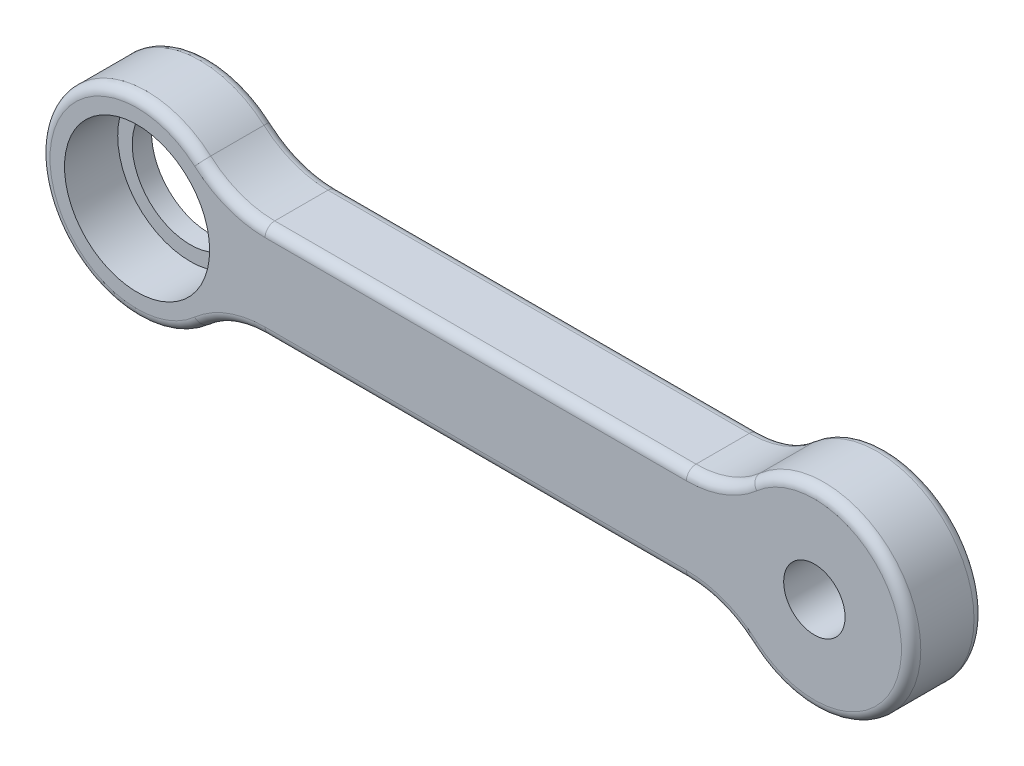
ISO-10303-21;
HEADER;
FILE_DESCRIPTION(('STEP AP214'),'2;1');
FILE_NAME('part.step','',(''),(''),'','','');
FILE_SCHEMA(('AUTOMOTIVE_DESIGN { 1 0 10303 214 1 1 1 1 }'));
ENDSEC;
DATA;
#1=APPLICATION_CONTEXT('core data for automotive mechanical design processes');
#2=APPLICATION_PROTOCOL_DEFINITION('international standard','automotive_design',2000,#1);
#3=PRODUCT_CONTEXT('',#1,'mechanical');
#4=PRODUCT('Part','Part','',(#3));
#5=PRODUCT_RELATED_PRODUCT_CATEGORY('part','',(#4));
#6=PRODUCT_DEFINITION_FORMATION('','',#4);
#7=PRODUCT_DEFINITION_CONTEXT('part definition',#1,'design');
#8=PRODUCT_DEFINITION('design','',#6,#7);
#9=PRODUCT_DEFINITION_SHAPE('','',#8);
#10=(LENGTH_UNIT() NAMED_UNIT(*) SI_UNIT(.MILLI.,.METRE.));
#11=(NAMED_UNIT(*) PLANE_ANGLE_UNIT() SI_UNIT($,.RADIAN.));
#12=(NAMED_UNIT(*) SI_UNIT($,.STERADIAN.) SOLID_ANGLE_UNIT());
#13=UNCERTAINTY_MEASURE_WITH_UNIT(LENGTH_MEASURE(1.E-05),#10,'distance_accuracy_value','');
#14=(GEOMETRIC_REPRESENTATION_CONTEXT(3) GLOBAL_UNCERTAINTY_ASSIGNED_CONTEXT((#13)) GLOBAL_UNIT_ASSIGNED_CONTEXT((#10,
#11,#12)) REPRESENTATION_CONTEXT('',''));
#15=CARTESIAN_POINT('',(0.,0.,0.));
#16=DIRECTION('',(0.,0.,1.));
#17=DIRECTION('',(1.,0.,0.));
#18=AXIS2_PLACEMENT_3D('',#15,#16,#17);
#19=CARTESIAN_POINT('',(21.7712434446771,-15.,7.5));
#20=DIRECTION('',(0.,0.,-1.));
#21=DIRECTION('',(-1.,0.,0.));
#22=AXIS2_PLACEMENT_3D('',#19,#20,#21);
#23=CYLINDRICAL_SURFACE('',#22,10.);
#24=DIRECTION('',(0.,0.,-1.));
#25=VECTOR('',#24,1.);
#26=CARTESIAN_POINT('',(21.7712434446771,-5.,7.5));
#27=LINE('',#26,#25);
#28=CARTESIAN_POINT('',(21.7712434446771,-5.,6.5));
#29=VERTEX_POINT('',#28);
#30=CARTESIAN_POINT('',(21.7712434446771,-5.,1.));
#31=VERTEX_POINT('',#30);
#32=EDGE_CURVE('E153',#29,#31,#27,.T.);
#33=ORIENTED_EDGE('',*,*,#32,.T.);
#34=CARTESIAN_POINT('',(21.7712434446771,-15.,1.));
#35=DIRECTION('',(0.,0.,-1.));
#36=DIRECTION('',(-1.,0.,0.));
#37=AXIS2_PLACEMENT_3D('',#34,#35,#36);
#38=CIRCLE('',#37,10.);
#39=CARTESIAN_POINT('',(28.3856217223385,-7.5,1.));
#40=VERTEX_POINT('',#39);
#41=EDGE_CURVE('E236',#31,#40,#38,.T.);
#42=ORIENTED_EDGE('',*,*,#41,.T.);
#43=DIRECTION('',(0.,0.,-1.));
#44=VECTOR('',#43,1.);
#45=CARTESIAN_POINT('',(28.3856217223385,-7.5,7.5));
#46=LINE('',#45,#44);
#47=CARTESIAN_POINT('',(28.3856217223385,-7.5,6.5));
#48=VERTEX_POINT('',#47);
#49=EDGE_CURVE('E177',#48,#40,#46,.T.);
#50=ORIENTED_EDGE('',*,*,#49,.F.);
#51=CARTESIAN_POINT('',(21.7712434446771,-15.,6.5));
#52=DIRECTION('',(0.,0.,-1.));
#53=DIRECTION('',(-1.,0.,0.));
#54=AXIS2_PLACEMENT_3D('',#51,#52,#53);
#55=CIRCLE('',#54,10.);
#56=EDGE_CURVE('E238',#48,#29,#55,.F.);
#57=ORIENTED_EDGE('',*,*,#56,.T.);
#58=EDGE_LOOP('',(#33,#42,#50,#57));
#59=FACE_BOUND('',#58,.T.);
#60=ADVANCED_FACE('F34',(#59),#23,.F.);
#61=CARTESIAN_POINT('',(35.,0.,7.5));
#62=DIRECTION('',(0.,0.,-1.));
#63=DIRECTION('',(-1.,0.,0.));
#64=AXIS2_PLACEMENT_3D('',#61,#62,#63);
#65=CYLINDRICAL_SURFACE('',#64,10.);
#66=ORIENTED_EDGE('',*,*,#49,.T.);
#67=CARTESIAN_POINT('',(35.,0.,1.));
#68=DIRECTION('',(0.,0.,-1.));
#69=DIRECTION('',(-1.,0.,0.));
#70=AXIS2_PLACEMENT_3D('',#67,#68,#69);
#71=CIRCLE('',#70,10.);
#72=CARTESIAN_POINT('',(28.3856217223385,7.5,1.));
#73=VERTEX_POINT('',#72);
#74=EDGE_CURVE('E240',#40,#73,#71,.F.);
#75=ORIENTED_EDGE('',*,*,#74,.T.);
#76=DIRECTION('',(0.,0.,-1.));
#77=VECTOR('',#76,1.);
#78=CARTESIAN_POINT('',(28.3856217223385,7.5,7.5));
#79=LINE('',#78,#77);
#80=CARTESIAN_POINT('',(28.3856217223385,7.5,6.5));
#81=VERTEX_POINT('',#80);
#82=EDGE_CURVE('E281',#81,#73,#79,.T.);
#83=ORIENTED_EDGE('',*,*,#82,.F.);
#84=CARTESIAN_POINT('',(35.,0.,6.5));
#85=DIRECTION('',(0.,0.,-1.));
#86=DIRECTION('',(-1.,0.,0.));
#87=AXIS2_PLACEMENT_3D('',#84,#85,#86);
#88=CIRCLE('',#87,10.);
#89=EDGE_CURVE('E242',#81,#48,#88,.T.);
#90=ORIENTED_EDGE('',*,*,#89,.T.);
#91=EDGE_LOOP('',(#66,#75,#83,#90));
#92=FACE_BOUND('',#91,.T.);
#93=ADVANCED_FACE('F349',(#92),#65,.T.);
#94=CARTESIAN_POINT('',(21.7712434446771,15.,7.5));
#95=DIRECTION('',(0.,0.,-1.));
#96=DIRECTION('',(-1.,0.,0.));
#97=AXIS2_PLACEMENT_3D('',#94,#95,#96);
#98=CYLINDRICAL_SURFACE('',#97,10.);
#99=ORIENTED_EDGE('',*,*,#82,.T.);
#100=CARTESIAN_POINT('',(21.7712434446771,15.,1.));
#101=DIRECTION('',(0.,0.,-1.));
#102=DIRECTION('',(-1.,0.,0.));
#103=AXIS2_PLACEMENT_3D('',#100,#101,#102);
#104=CIRCLE('',#103,10.);
#105=CARTESIAN_POINT('',(21.7712434446771,5.,1.));
#106=VERTEX_POINT('',#105);
#107=EDGE_CURVE('E244',#73,#106,#104,.T.);
#108=ORIENTED_EDGE('',*,*,#107,.T.);
#109=DIRECTION('',(0.,0.,-1.));
#110=VECTOR('',#109,1.);
#111=CARTESIAN_POINT('',(21.7712434446771,5.,7.5));
#112=LINE('',#111,#110);
#113=CARTESIAN_POINT('',(21.7712434446771,5.,6.5));
#114=VERTEX_POINT('',#113);
#115=EDGE_CURVE('E284',#114,#106,#112,.T.);
#116=ORIENTED_EDGE('',*,*,#115,.F.);
#117=CARTESIAN_POINT('',(21.7712434446771,15.,6.5));
#118=DIRECTION('',(0.,0.,-1.));
#119=DIRECTION('',(-1.,0.,0.));
#120=AXIS2_PLACEMENT_3D('',#117,#118,#119);
#121=CIRCLE('',#120,10.);
#122=EDGE_CURVE('E246',#114,#81,#121,.F.);
#123=ORIENTED_EDGE('',*,*,#122,.T.);
#124=EDGE_LOOP('',(#99,#108,#116,#123));
#125=FACE_BOUND('',#124,.T.);
#126=ADVANCED_FACE('F355',(#125),#98,.F.);
#127=CARTESIAN_POINT('',(-21.7712434446771,5.,7.5));
#128=DIRECTION('',(0.,-1.,0.));
#129=DIRECTION('',(0.,0.,-1.));
#130=AXIS2_PLACEMENT_3D('',#127,#128,#129);
#131=PLANE('',#130);
#132=ORIENTED_EDGE('',*,*,#115,.T.);
#133=DIRECTION('',(-1.,0.,0.));
#134=VECTOR('',#133,1.);
#135=CARTESIAN_POINT('',(-21.771243444677,5.,1.));
#136=LINE('',#135,#134);
#137=CARTESIAN_POINT('',(-21.771243444677,5.,1.));
#138=VERTEX_POINT('',#137);
#139=EDGE_CURVE('E249',#106,#138,#136,.T.);
#140=ORIENTED_EDGE('',*,*,#139,.T.);
#141=DIRECTION('',(0.,0.,-1.));
#142=VECTOR('',#141,1.);
#143=CARTESIAN_POINT('',(-21.771243444677,5.,7.5));
#144=LINE('',#143,#142);
#145=CARTESIAN_POINT('',(-21.771243444677,5.,6.5));
#146=VERTEX_POINT('',#145);
#147=EDGE_CURVE('E287',#146,#138,#144,.T.);
#148=ORIENTED_EDGE('',*,*,#147,.F.);
#149=DIRECTION('',(-1.,0.,0.));
#150=VECTOR('',#149,1.);
#151=CARTESIAN_POINT('',(-21.7712434446771,5.,6.5));
#152=LINE('',#151,#150);
#153=EDGE_CURVE('E251',#146,#114,#152,.F.);
#154=ORIENTED_EDGE('',*,*,#153,.T.);
#155=EDGE_LOOP('',(#132,#140,#148,#154));
#156=FACE_BOUND('',#155,.T.);
#157=ADVANCED_FACE('F508',(#156),#131,.F.);
#158=CARTESIAN_POINT('',(-21.7712434446771,15.,7.5));
#159=DIRECTION('',(0.,0.,-1.));
#160=DIRECTION('',(-1.,0.,0.));
#161=AXIS2_PLACEMENT_3D('',#158,#159,#160);
#162=CYLINDRICAL_SURFACE('',#161,10.);
#163=ORIENTED_EDGE('',*,*,#147,.T.);
#164=CARTESIAN_POINT('',(-21.7712434446771,15.,1.));
#165=DIRECTION('',(0.,0.,-1.));
#166=DIRECTION('',(-1.,0.,0.));
#167=AXIS2_PLACEMENT_3D('',#164,#165,#166);
#168=CIRCLE('',#167,10.);
#169=CARTESIAN_POINT('',(-28.3856217223385,7.5,1.));
#170=VERTEX_POINT('',#169);
#171=EDGE_CURVE('E253',#138,#170,#168,.T.);
#172=ORIENTED_EDGE('',*,*,#171,.T.);
#173=DIRECTION('',(0.,0.,-1.));
#174=VECTOR('',#173,1.);
#175=CARTESIAN_POINT('',(-28.3856217223385,7.5,7.5));
#176=LINE('',#175,#174);
#177=CARTESIAN_POINT('',(-28.3856217223385,7.5,6.5));
#178=VERTEX_POINT('',#177);
#179=EDGE_CURVE('E290',#178,#170,#176,.T.);
#180=ORIENTED_EDGE('',*,*,#179,.F.);
#181=CARTESIAN_POINT('',(-21.7712434446771,15.,6.5));
#182=DIRECTION('',(0.,0.,-1.));
#183=DIRECTION('',(-1.,0.,0.));
#184=AXIS2_PLACEMENT_3D('',#181,#182,#183);
#185=CIRCLE('',#184,10.);
#186=EDGE_CURVE('E255',#178,#146,#185,.F.);
#187=ORIENTED_EDGE('',*,*,#186,.T.);
#188=EDGE_LOOP('',(#163,#172,#180,#187));
#189=FACE_BOUND('',#188,.T.);
#190=ADVANCED_FACE('F500',(#189),#162,.F.);
#191=CARTESIAN_POINT('',(-35.,0.,7.5));
#192=DIRECTION('',(0.,0.,-1.));
#193=DIRECTION('',(-1.,0.,0.));
#194=AXIS2_PLACEMENT_3D('',#191,#192,#193);
#195=CYLINDRICAL_SURFACE('',#194,10.);
#196=ORIENTED_EDGE('',*,*,#179,.T.);
#197=CARTESIAN_POINT('',(-35.,0.,1.));
#198=DIRECTION('',(0.,0.,-1.));
#199=DIRECTION('',(-1.,0.,0.));
#200=AXIS2_PLACEMENT_3D('',#197,#198,#199);
#201=CIRCLE('',#200,10.);
#202=CARTESIAN_POINT('',(-28.3856217223385,-7.5,1.));
#203=VERTEX_POINT('',#202);
#204=EDGE_CURVE('E257',#170,#203,#201,.F.);
#205=ORIENTED_EDGE('',*,*,#204,.T.);
#206=DIRECTION('',(0.,0.,-1.));
#207=VECTOR('',#206,1.);
#208=CARTESIAN_POINT('',(-28.3856217223385,-7.5,7.5));
#209=LINE('',#208,#207);
#210=CARTESIAN_POINT('',(-28.3856217223385,-7.5,6.5));
#211=VERTEX_POINT('',#210);
#212=EDGE_CURVE('E167',#211,#203,#209,.T.);
#213=ORIENTED_EDGE('',*,*,#212,.F.);
#214=CARTESIAN_POINT('',(-35.,0.,6.5));
#215=DIRECTION('',(0.,0.,-1.));
#216=DIRECTION('',(-1.,0.,0.));
#217=AXIS2_PLACEMENT_3D('',#214,#215,#216);
#218=CIRCLE('',#217,10.);
#219=EDGE_CURVE('E259',#211,#178,#218,.T.);
#220=ORIENTED_EDGE('',*,*,#219,.T.);
#221=EDGE_LOOP('',(#196,#205,#213,#220));
#222=FACE_BOUND('',#221,.T.);
#223=ADVANCED_FACE('F493',(#222),#195,.T.);
#224=CARTESIAN_POINT('',(-21.7712434446771,-15.,7.5));
#225=DIRECTION('',(0.,0.,-1.));
#226=DIRECTION('',(-1.,0.,0.));
#227=AXIS2_PLACEMENT_3D('',#224,#225,#226);
#228=CYLINDRICAL_SURFACE('',#227,10.);
#229=ORIENTED_EDGE('',*,*,#212,.T.);
#230=CARTESIAN_POINT('',(-21.7712434446771,-15.,1.));
#231=DIRECTION('',(0.,0.,-1.));
#232=DIRECTION('',(-1.,0.,0.));
#233=AXIS2_PLACEMENT_3D('',#230,#231,#232);
#234=CIRCLE('',#233,10.);
#235=CARTESIAN_POINT('',(-21.7712434446771,-5.,1.));
#236=VERTEX_POINT('',#235);
#237=EDGE_CURVE('E166',#203,#236,#234,.T.);
#238=ORIENTED_EDGE('',*,*,#237,.T.);
#239=DIRECTION('',(0.,0.,-1.));
#240=VECTOR('',#239,1.);
#241=CARTESIAN_POINT('',(-21.7712434446771,-5.,7.5));
#242=LINE('',#241,#240);
#243=CARTESIAN_POINT('',(-21.7712434446771,-5.,6.5));
#244=VERTEX_POINT('',#243);
#245=EDGE_CURVE('E151',#244,#236,#242,.T.);
#246=ORIENTED_EDGE('',*,*,#245,.F.);
#247=CARTESIAN_POINT('',(-21.7712434446771,-15.,6.5));
#248=DIRECTION('',(0.,0.,-1.));
#249=DIRECTION('',(-1.,0.,0.));
#250=AXIS2_PLACEMENT_3D('',#247,#248,#249);
#251=CIRCLE('',#250,10.);
#252=EDGE_CURVE('E163',#244,#211,#251,.F.);
#253=ORIENTED_EDGE('',*,*,#252,.T.);
#254=EDGE_LOOP('',(#229,#238,#246,#253));
#255=FACE_BOUND('',#254,.T.);
#256=ADVANCED_FACE('F162',(#255),#228,.F.);
#257=CARTESIAN_POINT('',(-21.7712434446771,-5.,7.5));
#258=DIRECTION('',(0.,1.,0.));
#259=DIRECTION('',(0.,0.,1.));
#260=AXIS2_PLACEMENT_3D('',#257,#258,#259);
#261=PLANE('',#260);
#262=ORIENTED_EDGE('',*,*,#32,.F.);
#263=DIRECTION('',(1.,0.,0.));
#264=VECTOR('',#263,1.);
#265=CARTESIAN_POINT('',(-21.7712434446771,-5.,6.5));
#266=LINE('',#265,#264);
#267=EDGE_CURVE('E12',#29,#244,#266,.F.);
#268=ORIENTED_EDGE('',*,*,#267,.T.);
#269=ORIENTED_EDGE('',*,*,#245,.T.);
#270=DIRECTION('',(1.,0.,0.));
#271=VECTOR('',#270,1.);
#272=CARTESIAN_POINT('',(21.7712434446771,-5.,1.));
#273=LINE('',#272,#271);
#274=EDGE_CURVE('E43',#236,#31,#273,.T.);
#275=ORIENTED_EDGE('',*,*,#274,.T.);
#276=EDGE_LOOP('',(#262,#268,#269,#275));
#277=FACE_BOUND('',#276,.T.);
#278=ADVANCED_FACE('F150',(#277),#261,.F.);
#279=CARTESIAN_POINT('',(21.7712434446771,-15.,7.5));
#280=DIRECTION('',(0.,0.,-1.));
#281=DIRECTION('',(-1.,0.,0.));
#282=AXIS2_PLACEMENT_3D('',#279,#280,#281);
#283=PLANE('',#282);
#284=CARTESIAN_POINT('',(35.,0.,7.5));
#285=DIRECTION('',(0.,0.,-1.));
#286=DIRECTION('',(-1.,0.,0.));
#287=AXIS2_PLACEMENT_3D('',#284,#285,#286);
#288=CIRCLE('',#287,9.);
#289=CARTESIAN_POINT('',(29.0470595501047,-6.75,7.5));
#290=VERTEX_POINT('',#289);
#291=CARTESIAN_POINT('',(29.0470595501047,6.75,7.5));
#292=VERTEX_POINT('',#291);
#293=EDGE_CURVE('E51',#290,#292,#288,.F.);
#294=ORIENTED_EDGE('',*,*,#293,.T.);
#295=CARTESIAN_POINT('',(21.7712434446771,15.,7.5));
#296=DIRECTION('',(0.,0.,-1.));
#297=DIRECTION('',(-1.,0.,0.));
#298=AXIS2_PLACEMENT_3D('',#295,#296,#297);
#299=CIRCLE('',#298,11.);
#300=CARTESIAN_POINT('',(21.7712434446771,4.,7.5));
#301=VERTEX_POINT('',#300);
#302=EDGE_CURVE('E223',#292,#301,#299,.T.);
#303=ORIENTED_EDGE('',*,*,#302,.T.);
#304=DIRECTION('',(-1.,0.,0.));
#305=VECTOR('',#304,1.);
#306=CARTESIAN_POINT('',(21.7712434446771,4.,7.5));
#307=LINE('',#306,#305);
#308=CARTESIAN_POINT('',(-21.771243444677,4.,7.5));
#309=VERTEX_POINT('',#308);
#310=EDGE_CURVE('E234',#301,#309,#307,.T.);
#311=ORIENTED_EDGE('',*,*,#310,.T.);
#312=CARTESIAN_POINT('',(-21.7712434446771,15.,7.5));
#313=DIRECTION('',(0.,0.,-1.));
#314=DIRECTION('',(-1.,0.,0.));
#315=AXIS2_PLACEMENT_3D('',#312,#313,#314);
#316=CIRCLE('',#315,11.);
#317=CARTESIAN_POINT('',(-29.0470595501047,6.75,7.5));
#318=VERTEX_POINT('',#317);
#319=EDGE_CURVE('E232',#309,#318,#316,.T.);
#320=ORIENTED_EDGE('',*,*,#319,.T.);
#321=CARTESIAN_POINT('',(-35.,0.,7.5));
#322=DIRECTION('',(0.,0.,-1.));
#323=DIRECTION('',(-1.,0.,0.));
#324=AXIS2_PLACEMENT_3D('',#321,#322,#323);
#325=CIRCLE('',#324,9.);
#326=CARTESIAN_POINT('',(-29.0470595501047,-6.75,7.5));
#327=VERTEX_POINT('',#326);
#328=EDGE_CURVE('E230',#318,#327,#325,.F.);
#329=ORIENTED_EDGE('',*,*,#328,.T.);
#330=CARTESIAN_POINT('',(-21.7712434446771,-15.,7.5));
#331=DIRECTION('',(0.,0.,-1.));
#332=DIRECTION('',(-1.,0.,0.));
#333=AXIS2_PLACEMENT_3D('',#330,#331,#332);
#334=CIRCLE('',#333,11.);
#335=CARTESIAN_POINT('',(-21.7712434446771,-4.,7.5));
#336=VERTEX_POINT('',#335);
#337=EDGE_CURVE('E228',#327,#336,#334,.T.);
#338=ORIENTED_EDGE('',*,*,#337,.T.);
#339=DIRECTION('',(1.,0.,0.));
#340=VECTOR('',#339,1.);
#341=CARTESIAN_POINT('',(21.7712434446771,-4.,7.5));
#342=LINE('',#341,#340);
#343=CARTESIAN_POINT('',(21.7712434446771,-4.,7.5));
#344=VERTEX_POINT('',#343);
#345=EDGE_CURVE('E180',#336,#344,#342,.T.);
#346=ORIENTED_EDGE('',*,*,#345,.T.);
#347=CARTESIAN_POINT('',(21.7712434446771,-15.,7.5));
#348=DIRECTION('',(0.,0.,-1.));
#349=DIRECTION('',(-1.,0.,0.));
#350=AXIS2_PLACEMENT_3D('',#347,#348,#349);
#351=CIRCLE('',#350,11.);
#352=EDGE_CURVE('E56',#344,#290,#351,.T.);
#353=ORIENTED_EDGE('',*,*,#352,.T.);
#354=EDGE_LOOP('',(#294,#303,#311,#320,#329,#338,#346,#353));
#355=FACE_BOUND('',#354,.T.);
#356=CARTESIAN_POINT('',(35.,0.,7.5));
#357=DIRECTION('',(0.,0.,-1.));
#358=DIRECTION('',(-1.,0.,0.));
#359=AXIS2_PLACEMENT_3D('',#356,#357,#358);
#360=CIRCLE('',#359,3.175);
#361=CARTESIAN_POINT('',(31.825,0.,7.5));
#362=VERTEX_POINT('',#361);
#363=EDGE_CURVE('E305',#362,#362,#360,.T.);
#364=ORIENTED_EDGE('',*,*,#363,.T.);
#365=EDGE_LOOP('',(#364));
#366=FACE_BOUND('',#365,.T.);
#367=CARTESIAN_POINT('',(-35.,0.,7.5));
#368=DIRECTION('',(0.,0.,1.));
#369=DIRECTION('',(1.,0.,0.));
#370=AXIS2_PLACEMENT_3D('',#367,#368,#369);
#371=CIRCLE('',#370,7.5);
#372=CARTESIAN_POINT('',(-27.5,0.,7.5));
#373=VERTEX_POINT('',#372);
#374=EDGE_CURVE('E298',#373,#373,#371,.T.);
#375=ORIENTED_EDGE('',*,*,#374,.F.);
#376=EDGE_LOOP('',(#375));
#377=FACE_BOUND('',#376,.T.);
#378=ADVANCED_FACE('F313',(#355,#366,#377),#283,.F.);
#379=CARTESIAN_POINT('',(21.7712434446771,-15.,0.));
#380=DIRECTION('',(0.,0.,-1.));
#381=DIRECTION('',(-1.,0.,0.));
#382=AXIS2_PLACEMENT_3D('',#379,#380,#381);
#383=PLANE('',#382);
#384=DIRECTION('',(1.,0.,0.));
#385=VECTOR('',#384,1.);
#386=CARTESIAN_POINT('',(-21.7712434446771,-4.,0.));
#387=LINE('',#386,#385);
#388=CARTESIAN_POINT('',(21.7712434446771,-4.,0.));
#389=VERTEX_POINT('',#388);
#390=CARTESIAN_POINT('',(-21.7712434446771,-4.,0.));
#391=VERTEX_POINT('',#390);
#392=EDGE_CURVE('E276',#389,#391,#387,.F.);
#393=ORIENTED_EDGE('',*,*,#392,.T.);
#394=CARTESIAN_POINT('',(-21.7712434446771,-15.,0.));
#395=DIRECTION('',(0.,0.,-1.));
#396=DIRECTION('',(-1.,0.,0.));
#397=AXIS2_PLACEMENT_3D('',#394,#395,#396);
#398=CIRCLE('',#397,11.);
#399=CARTESIAN_POINT('',(-29.0470595501047,-6.75,0.));
#400=VERTEX_POINT('',#399);
#401=EDGE_CURVE('E261',#391,#400,#398,.F.);
#402=ORIENTED_EDGE('',*,*,#401,.T.);
#403=CARTESIAN_POINT('',(-35.,0.,0.));
#404=DIRECTION('',(0.,0.,-1.));
#405=DIRECTION('',(-1.,0.,0.));
#406=AXIS2_PLACEMENT_3D('',#403,#404,#405);
#407=CIRCLE('',#406,9.);
#408=CARTESIAN_POINT('',(-29.0470595501047,6.75,0.));
#409=VERTEX_POINT('',#408);
#410=EDGE_CURVE('E264',#400,#409,#407,.T.);
#411=ORIENTED_EDGE('',*,*,#410,.T.);
#412=CARTESIAN_POINT('',(-21.7712434446771,15.,0.));
#413=DIRECTION('',(0.,0.,-1.));
#414=DIRECTION('',(-1.,0.,0.));
#415=AXIS2_PLACEMENT_3D('',#412,#413,#414);
#416=CIRCLE('',#415,11.);
#417=CARTESIAN_POINT('',(-21.771243444677,4.,0.));
#418=VERTEX_POINT('',#417);
#419=EDGE_CURVE('E266',#409,#418,#416,.F.);
#420=ORIENTED_EDGE('',*,*,#419,.T.);
#421=DIRECTION('',(-1.,0.,0.));
#422=VECTOR('',#421,1.);
#423=CARTESIAN_POINT('',(21.7712434446771,4.,0.));
#424=LINE('',#423,#422);
#425=CARTESIAN_POINT('',(21.7712434446771,4.,0.));
#426=VERTEX_POINT('',#425);
#427=EDGE_CURVE('E268',#418,#426,#424,.F.);
#428=ORIENTED_EDGE('',*,*,#427,.T.);
#429=CARTESIAN_POINT('',(21.7712434446771,15.,0.));
#430=DIRECTION('',(0.,0.,-1.));
#431=DIRECTION('',(-1.,0.,0.));
#432=AXIS2_PLACEMENT_3D('',#429,#430,#431);
#433=CIRCLE('',#432,11.);
#434=CARTESIAN_POINT('',(29.0470595501047,6.75,0.));
#435=VERTEX_POINT('',#434);
#436=EDGE_CURVE('E270',#426,#435,#433,.F.);
#437=ORIENTED_EDGE('',*,*,#436,.T.);
#438=CARTESIAN_POINT('',(35.,0.,0.));
#439=DIRECTION('',(0.,0.,-1.));
#440=DIRECTION('',(-1.,0.,0.));
#441=AXIS2_PLACEMENT_3D('',#438,#439,#440);
#442=CIRCLE('',#441,9.);
#443=CARTESIAN_POINT('',(29.0470595501047,-6.75,0.));
#444=VERTEX_POINT('',#443);
#445=EDGE_CURVE('E272',#435,#444,#442,.T.);
#446=ORIENTED_EDGE('',*,*,#445,.T.);
#447=CARTESIAN_POINT('',(21.7712434446771,-15.,0.));
#448=DIRECTION('',(0.,0.,-1.));
#449=DIRECTION('',(-1.,0.,0.));
#450=AXIS2_PLACEMENT_3D('',#447,#448,#449);
#451=CIRCLE('',#450,11.);
#452=EDGE_CURVE('E274',#444,#389,#451,.F.);
#453=ORIENTED_EDGE('',*,*,#452,.T.);
#454=EDGE_LOOP('',(#393,#402,#411,#420,#428,#437,#446,#453));
#455=FACE_BOUND('',#454,.T.);
#456=CARTESIAN_POINT('',(35.,0.,0.));
#457=DIRECTION('',(0.,0.,-1.));
#458=DIRECTION('',(-1.,0.,0.));
#459=AXIS2_PLACEMENT_3D('',#456,#457,#458);
#460=CIRCLE('',#459,3.175);
#461=CARTESIAN_POINT('',(31.825,0.,0.));
#462=VERTEX_POINT('',#461);
#463=EDGE_CURVE('E205',#462,#462,#460,.T.);
#464=ORIENTED_EDGE('',*,*,#463,.F.);
#465=EDGE_LOOP('',(#464));
#466=FACE_BOUND('',#465,.T.);
#467=CARTESIAN_POINT('',(-35.,0.,0.));
#468=DIRECTION('',(0.,0.,1.));
#469=DIRECTION('',(1.,0.,0.));
#470=AXIS2_PLACEMENT_3D('',#467,#468,#469);
#471=CIRCLE('',#470,6.);
#472=CARTESIAN_POINT('',(-29.,0.,0.));
#473=VERTEX_POINT('',#472);
#474=EDGE_CURVE('E301',#473,#473,#471,.T.);
#475=ORIENTED_EDGE('',*,*,#474,.T.);
#476=EDGE_LOOP('',(#475));
#477=FACE_BOUND('',#476,.T.);
#478=ADVANCED_FACE('F324',(#455,#466,#477),#383,.T.);
#479=CARTESIAN_POINT('',(21.7712434446771,-15.,2.));
#480=DIRECTION('',(0.,0.,-1.));
#481=DIRECTION('',(-1.,0.,0.));
#482=AXIS2_PLACEMENT_3D('',#479,#480,#481);
#483=PLANE('',#482);
#484=CARTESIAN_POINT('',(-35.,0.,2.));
#485=DIRECTION('',(0.,0.,1.));
#486=DIRECTION('',(1.,0.,0.));
#487=AXIS2_PLACEMENT_3D('',#484,#485,#486);
#488=CIRCLE('',#487,6.);
#489=CARTESIAN_POINT('',(-29.,0.,2.));
#490=VERTEX_POINT('',#489);
#491=EDGE_CURVE('E302',#490,#490,#488,.T.);
#492=ORIENTED_EDGE('',*,*,#491,.F.);
#493=EDGE_LOOP('',(#492));
#494=FACE_BOUND('',#493,.T.);
#495=CARTESIAN_POINT('',(-35.,0.,2.));
#496=DIRECTION('',(0.,0.,-1.));
#497=DIRECTION('',(-1.,0.,0.));
#498=AXIS2_PLACEMENT_3D('',#495,#496,#497);
#499=CIRCLE('',#498,7.5);
#500=CARTESIAN_POINT('',(-42.5,0.,2.));
#501=VERTEX_POINT('',#500);
#502=EDGE_CURVE('E295',#501,#501,#499,.F.);
#503=ORIENTED_EDGE('',*,*,#502,.T.);
#504=EDGE_LOOP('',(#503));
#505=FACE_BOUND('',#504,.T.);
#506=ADVANCED_FACE('F327',(#494,#505),#483,.F.);
#507=CARTESIAN_POINT('',(-35.,0.,-21.2132034355964));
#508=DIRECTION('',(0.,0.,1.));
#509=DIRECTION('',(1.,0.,0.));
#510=AXIS2_PLACEMENT_3D('',#507,#508,#509);
#511=CYLINDRICAL_SURFACE('',#510,7.5);
#512=ORIENTED_EDGE('',*,*,#374,.T.);
#513=EDGE_LOOP('',(#512));
#514=FACE_BOUND('',#513,.T.);
#515=ORIENTED_EDGE('',*,*,#502,.F.);
#516=EDGE_LOOP('',(#515));
#517=FACE_BOUND('',#516,.T.);
#518=ADVANCED_FACE('F334',(#514,#517),#511,.F.);
#519=CARTESIAN_POINT('',(-35.,0.,0.));
#520=DIRECTION('',(0.,0.,1.));
#521=DIRECTION('',(1.,0.,0.));
#522=AXIS2_PLACEMENT_3D('',#519,#520,#521);
#523=CYLINDRICAL_SURFACE('',#522,6.);
#524=ORIENTED_EDGE('',*,*,#474,.F.);
#525=EDGE_LOOP('',(#524));
#526=FACE_BOUND('',#525,.T.);
#527=ORIENTED_EDGE('',*,*,#491,.T.);
#528=EDGE_LOOP('',(#527));
#529=FACE_BOUND('',#528,.T.);
#530=ADVANCED_FACE('F320',(#526,#529),#523,.F.);
#531=CARTESIAN_POINT('',(35.,0.,7.5));
#532=DIRECTION('',(0.,0.,-1.));
#533=DIRECTION('',(-1.,0.,0.));
#534=AXIS2_PLACEMENT_3D('',#531,#532,#533);
#535=CYLINDRICAL_SURFACE('',#534,3.175);
#536=ORIENTED_EDGE('',*,*,#363,.F.);
#537=EDGE_LOOP('',(#536));
#538=FACE_BOUND('',#537,.T.);
#539=ORIENTED_EDGE('',*,*,#463,.T.);
#540=EDGE_LOOP('',(#539));
#541=FACE_BOUND('',#540,.T.);
#542=ADVANCED_FACE('F316',(#538,#541),#535,.F.);
#543=CARTESIAN_POINT('',(21.7712434446771,15.,1.));
#544=DIRECTION('',(0.,0.,-1.));
#545=DIRECTION('',(-1.,0.,0.));
#546=AXIS2_PLACEMENT_3D('',#543,#544,#545);
#547=TOROIDAL_SURFACE('',#546,11.,1.);
#548=CARTESIAN_POINT('',(29.0470595501047,6.75,1.));
#549=DIRECTION('',(0.749999999999999,0.661437827766148,0.));
#550=DIRECTION('',(-0.661437827766148,0.749999999999999,0.));
#551=AXIS2_PLACEMENT_3D('',#548,#549,#550);
#552=CIRCLE('',#551,1.);
#553=EDGE_CURVE('E206',#435,#73,#552,.T.);
#554=ORIENTED_EDGE('',*,*,#553,.F.);
#555=ORIENTED_EDGE('',*,*,#436,.F.);
#556=CARTESIAN_POINT('',(21.7712434446771,4.,1.));
#557=DIRECTION('',(-1.,0.,0.));
#558=DIRECTION('',(0.,0.,1.));
#559=AXIS2_PLACEMENT_3D('',#556,#557,#558);
#560=CIRCLE('',#559,1.);
#561=EDGE_CURVE('E202',#106,#426,#560,.T.);
#562=ORIENTED_EDGE('',*,*,#561,.F.);
#563=ORIENTED_EDGE('',*,*,#107,.F.);
#564=EDGE_LOOP('',(#554,#555,#562,#563));
#565=FACE_BOUND('',#564,.T.);
#566=ADVANCED_FACE('F319',(#565),#547,.T.);
#567=CARTESIAN_POINT('',(-21.7712434446771,4.,1.));
#568=DIRECTION('',(1.,0.,0.));
#569=DIRECTION('',(0.,0.,-1.));
#570=AXIS2_PLACEMENT_3D('',#567,#568,#569);
#571=CYLINDRICAL_SURFACE('',#570,1.);
#572=ORIENTED_EDGE('',*,*,#561,.T.);
#573=ORIENTED_EDGE('',*,*,#427,.F.);
#574=CARTESIAN_POINT('',(-21.771243444677,4.,1.));
#575=DIRECTION('',(-1.,0.,0.));
#576=DIRECTION('',(0.,0.,1.));
#577=AXIS2_PLACEMENT_3D('',#574,#575,#576);
#578=CIRCLE('',#577,1.);
#579=EDGE_CURVE('E209',#138,#418,#578,.T.);
#580=ORIENTED_EDGE('',*,*,#579,.F.);
#581=ORIENTED_EDGE('',*,*,#139,.F.);
#582=EDGE_LOOP('',(#572,#573,#580,#581));
#583=FACE_BOUND('',#582,.T.);
#584=ADVANCED_FACE('F383',(#583),#571,.T.);
#585=CARTESIAN_POINT('',(35.,0.,1.));
#586=DIRECTION('',(0.,0.,-1.));
#587=DIRECTION('',(-1.,0.,0.));
#588=AXIS2_PLACEMENT_3D('',#585,#586,#587);
#589=TOROIDAL_SURFACE('',#588,9.,1.);
#590=ORIENTED_EDGE('',*,*,#553,.T.);
#591=ORIENTED_EDGE('',*,*,#74,.F.);
#592=CARTESIAN_POINT('',(29.0470595501047,-6.75,1.));
#593=DIRECTION('',(-0.749999999999999,0.661437827766148,0.));
#594=DIRECTION('',(-0.661437827766148,-0.749999999999999,0.));
#595=AXIS2_PLACEMENT_3D('',#592,#593,#594);
#596=CIRCLE('',#595,1.);
#597=EDGE_CURVE('E212',#444,#40,#596,.T.);
#598=ORIENTED_EDGE('',*,*,#597,.F.);
#599=ORIENTED_EDGE('',*,*,#445,.F.);
#600=EDGE_LOOP('',(#590,#591,#598,#599));
#601=FACE_BOUND('',#600,.T.);
#602=ADVANCED_FACE('F379',(#601),#589,.T.);
#603=CARTESIAN_POINT('',(-21.7712434446771,15.,1.));
#604=DIRECTION('',(0.,0.,-1.));
#605=DIRECTION('',(-1.,0.,0.));
#606=AXIS2_PLACEMENT_3D('',#603,#604,#605);
#607=TOROIDAL_SURFACE('',#606,11.,1.);
#608=ORIENTED_EDGE('',*,*,#579,.T.);
#609=ORIENTED_EDGE('',*,*,#419,.F.);
#610=CARTESIAN_POINT('',(-29.0470595501047,6.75,1.));
#611=DIRECTION('',(-0.75,0.661437827766148,0.));
#612=DIRECTION('',(-0.661437827766148,-0.75,0.));
#613=AXIS2_PLACEMENT_3D('',#610,#611,#612);
#614=CIRCLE('',#613,1.);
#615=EDGE_CURVE('E215',#170,#409,#614,.T.);
#616=ORIENTED_EDGE('',*,*,#615,.F.);
#617=ORIENTED_EDGE('',*,*,#171,.F.);
#618=EDGE_LOOP('',(#608,#609,#616,#617));
#619=FACE_BOUND('',#618,.T.);
#620=ADVANCED_FACE('F375',(#619),#607,.T.);
#621=CARTESIAN_POINT('',(21.7712434446771,-15.,1.));
#622=DIRECTION('',(0.,0.,-1.));
#623=DIRECTION('',(-1.,0.,0.));
#624=AXIS2_PLACEMENT_3D('',#621,#622,#623);
#625=TOROIDAL_SURFACE('',#624,11.,1.);
#626=ORIENTED_EDGE('',*,*,#597,.T.);
#627=ORIENTED_EDGE('',*,*,#41,.F.);
#628=CARTESIAN_POINT('',(21.7712434446771,-4.,1.));
#629=DIRECTION('',(-1.,0.,0.));
#630=DIRECTION('',(0.,0.,1.));
#631=AXIS2_PLACEMENT_3D('',#628,#629,#630);
#632=CIRCLE('',#631,1.);
#633=EDGE_CURVE('E218',#389,#31,#632,.T.);
#634=ORIENTED_EDGE('',*,*,#633,.F.);
#635=ORIENTED_EDGE('',*,*,#452,.F.);
#636=EDGE_LOOP('',(#626,#627,#634,#635));
#637=FACE_BOUND('',#636,.T.);
#638=ADVANCED_FACE('F371',(#637),#625,.T.);
#639=CARTESIAN_POINT('',(-35.,0.,1.));
#640=DIRECTION('',(0.,0.,-1.));
#641=DIRECTION('',(-1.,0.,0.));
#642=AXIS2_PLACEMENT_3D('',#639,#640,#641);
#643=TOROIDAL_SURFACE('',#642,9.,1.);
#644=ORIENTED_EDGE('',*,*,#615,.T.);
#645=ORIENTED_EDGE('',*,*,#410,.F.);
#646=CARTESIAN_POINT('',(-29.0470595501047,-6.75,1.));
#647=DIRECTION('',(0.75,0.661437827766148,0.));
#648=DIRECTION('',(-0.661437827766148,0.75,0.));
#649=AXIS2_PLACEMENT_3D('',#646,#647,#648);
#650=CIRCLE('',#649,1.);
#651=EDGE_CURVE('E182',#203,#400,#650,.T.);
#652=ORIENTED_EDGE('',*,*,#651,.F.);
#653=ORIENTED_EDGE('',*,*,#204,.F.);
#654=EDGE_LOOP('',(#644,#645,#652,#653));
#655=FACE_BOUND('',#654,.T.);
#656=ADVANCED_FACE('F367',(#655),#643,.T.);
#657=CARTESIAN_POINT('',(-21.7712434446771,-4.,1.));
#658=DIRECTION('',(-1.,0.,0.));
#659=DIRECTION('',(0.,0.,1.));
#660=AXIS2_PLACEMENT_3D('',#657,#658,#659);
#661=CYLINDRICAL_SURFACE('',#660,1.);
#662=ORIENTED_EDGE('',*,*,#633,.T.);
#663=ORIENTED_EDGE('',*,*,#274,.F.);
#664=CARTESIAN_POINT('',(-21.7712434446771,-4.,1.));
#665=DIRECTION('',(-1.,0.,0.));
#666=DIRECTION('',(0.,0.,1.));
#667=AXIS2_PLACEMENT_3D('',#664,#665,#666);
#668=CIRCLE('',#667,1.);
#669=EDGE_CURVE('E181',#391,#236,#668,.T.);
#670=ORIENTED_EDGE('',*,*,#669,.F.);
#671=ORIENTED_EDGE('',*,*,#392,.F.);
#672=EDGE_LOOP('',(#662,#663,#670,#671));
#673=FACE_BOUND('',#672,.T.);
#674=ADVANCED_FACE('F363',(#673),#661,.T.);
#675=CARTESIAN_POINT('',(-21.7712434446771,-15.,1.));
#676=DIRECTION('',(0.,0.,-1.));
#677=DIRECTION('',(-1.,0.,0.));
#678=AXIS2_PLACEMENT_3D('',#675,#676,#677);
#679=TOROIDAL_SURFACE('',#678,11.,1.);
#680=ORIENTED_EDGE('',*,*,#651,.T.);
#681=ORIENTED_EDGE('',*,*,#401,.F.);
#682=ORIENTED_EDGE('',*,*,#669,.T.);
#683=ORIENTED_EDGE('',*,*,#237,.F.);
#684=EDGE_LOOP('',(#680,#681,#682,#683));
#685=FACE_BOUND('',#684,.T.);
#686=ADVANCED_FACE('F360',(#685),#679,.T.);
#687=CARTESIAN_POINT('',(-21.7712434446771,-15.,6.5));
#688=DIRECTION('',(0.,0.,-1.));
#689=DIRECTION('',(-1.,0.,0.));
#690=AXIS2_PLACEMENT_3D('',#687,#688,#689);
#691=TOROIDAL_SURFACE('',#690,11.,1.);
#692=CARTESIAN_POINT('',(-29.0470595501047,-6.75,6.5));
#693=DIRECTION('',(-0.75,-0.661437827766148,0.));
#694=DIRECTION('',(0.661437827766148,-0.75,0.));
#695=AXIS2_PLACEMENT_3D('',#692,#693,#694);
#696=CIRCLE('',#695,1.);
#697=EDGE_CURVE('E175',#211,#327,#696,.T.);
#698=ORIENTED_EDGE('',*,*,#697,.F.);
#699=ORIENTED_EDGE('',*,*,#252,.F.);
#700=CARTESIAN_POINT('',(-21.7712434446771,-4.,6.5));
#701=DIRECTION('',(1.,0.,0.));
#702=DIRECTION('',(0.,0.,-1.));
#703=AXIS2_PLACEMENT_3D('',#700,#701,#702);
#704=CIRCLE('',#703,1.);
#705=EDGE_CURVE('E38',#336,#244,#704,.T.);
#706=ORIENTED_EDGE('',*,*,#705,.F.);
#707=ORIENTED_EDGE('',*,*,#337,.F.);
#708=EDGE_LOOP('',(#698,#699,#706,#707));
#709=FACE_BOUND('',#708,.T.);
#710=ADVANCED_FACE('F36',(#709),#691,.T.);
#711=CARTESIAN_POINT('',(21.7712434446771,-4.,6.5));
#712=DIRECTION('',(1.,0.,0.));
#713=DIRECTION('',(0.,0.,-1.));
#714=AXIS2_PLACEMENT_3D('',#711,#712,#713);
#715=CYLINDRICAL_SURFACE('',#714,1.);
#716=ORIENTED_EDGE('',*,*,#705,.T.);
#717=ORIENTED_EDGE('',*,*,#267,.F.);
#718=CARTESIAN_POINT('',(21.7712434446771,-4.,6.5));
#719=DIRECTION('',(1.,0.,0.));
#720=DIRECTION('',(0.,0.,-1.));
#721=AXIS2_PLACEMENT_3D('',#718,#719,#720);
#722=CIRCLE('',#721,1.);
#723=EDGE_CURVE('E184',#344,#29,#722,.T.);
#724=ORIENTED_EDGE('',*,*,#723,.F.);
#725=ORIENTED_EDGE('',*,*,#345,.F.);
#726=EDGE_LOOP('',(#716,#717,#724,#725));
#727=FACE_BOUND('',#726,.T.);
#728=ADVANCED_FACE('F179',(#727),#715,.T.);
#729=CARTESIAN_POINT('',(-35.,0.,6.5));
#730=DIRECTION('',(0.,0.,-1.));
#731=DIRECTION('',(-1.,0.,0.));
#732=AXIS2_PLACEMENT_3D('',#729,#730,#731);
#733=TOROIDAL_SURFACE('',#732,9.,1.);
#734=ORIENTED_EDGE('',*,*,#697,.T.);
#735=ORIENTED_EDGE('',*,*,#328,.F.);
#736=CARTESIAN_POINT('',(-29.0470595501047,6.75,6.5));
#737=DIRECTION('',(0.75,-0.661437827766148,0.));
#738=DIRECTION('',(0.661437827766148,0.75,0.));
#739=AXIS2_PLACEMENT_3D('',#736,#737,#738);
#740=CIRCLE('',#739,1.);
#741=EDGE_CURVE('E187',#178,#318,#740,.T.);
#742=ORIENTED_EDGE('',*,*,#741,.F.);
#743=ORIENTED_EDGE('',*,*,#219,.F.);
#744=EDGE_LOOP('',(#734,#735,#742,#743));
#745=FACE_BOUND('',#744,.T.);
#746=ADVANCED_FACE('F410',(#745),#733,.T.);
#747=CARTESIAN_POINT('',(21.7712434446771,-15.,6.5));
#748=DIRECTION('',(0.,0.,-1.));
#749=DIRECTION('',(-1.,0.,0.));
#750=AXIS2_PLACEMENT_3D('',#747,#748,#749);
#751=TOROIDAL_SURFACE('',#750,11.,1.);
#752=ORIENTED_EDGE('',*,*,#723,.T.);
#753=ORIENTED_EDGE('',*,*,#56,.F.);
#754=CARTESIAN_POINT('',(29.0470595501047,-6.75,6.5));
#755=DIRECTION('',(0.749999999999999,-0.661437827766148,0.));
#756=DIRECTION('',(0.661437827766148,0.749999999999999,0.));
#757=AXIS2_PLACEMENT_3D('',#754,#755,#756);
#758=CIRCLE('',#757,1.);
#759=EDGE_CURVE('E192',#290,#48,#758,.T.);
#760=ORIENTED_EDGE('',*,*,#759,.F.);
#761=ORIENTED_EDGE('',*,*,#352,.F.);
#762=EDGE_LOOP('',(#752,#753,#760,#761));
#763=FACE_BOUND('',#762,.T.);
#764=ADVANCED_FACE('F406',(#763),#751,.T.);
#765=CARTESIAN_POINT('',(-21.7712434446771,15.,6.5));
#766=DIRECTION('',(0.,0.,-1.));
#767=DIRECTION('',(-1.,0.,0.));
#768=AXIS2_PLACEMENT_3D('',#765,#766,#767);
#769=TOROIDAL_SURFACE('',#768,11.,1.);
#770=ORIENTED_EDGE('',*,*,#741,.T.);
#771=ORIENTED_EDGE('',*,*,#319,.F.);
#772=CARTESIAN_POINT('',(-21.771243444677,4.,6.5));
#773=DIRECTION('',(1.,0.,0.));
#774=DIRECTION('',(0.,0.,-1.));
#775=AXIS2_PLACEMENT_3D('',#772,#773,#774);
#776=CIRCLE('',#775,1.);
#777=EDGE_CURVE('E195',#146,#309,#776,.T.);
#778=ORIENTED_EDGE('',*,*,#777,.F.);
#779=ORIENTED_EDGE('',*,*,#186,.F.);
#780=EDGE_LOOP('',(#770,#771,#778,#779));
#781=FACE_BOUND('',#780,.T.);
#782=ADVANCED_FACE('F402',(#781),#769,.T.);
#783=CARTESIAN_POINT('',(35.,0.,6.5));
#784=DIRECTION('',(0.,0.,-1.));
#785=DIRECTION('',(-1.,0.,0.));
#786=AXIS2_PLACEMENT_3D('',#783,#784,#785);
#787=TOROIDAL_SURFACE('',#786,9.,1.);
#788=ORIENTED_EDGE('',*,*,#759,.T.);
#789=ORIENTED_EDGE('',*,*,#89,.F.);
#790=CARTESIAN_POINT('',(29.0470595501047,6.75,6.5));
#791=DIRECTION('',(-0.749999999999999,-0.661437827766148,0.));
#792=DIRECTION('',(0.661437827766148,-0.749999999999999,0.));
#793=AXIS2_PLACEMENT_3D('',#790,#791,#792);
#794=CIRCLE('',#793,1.);
#795=EDGE_CURVE('E198',#292,#81,#794,.T.);
#796=ORIENTED_EDGE('',*,*,#795,.F.);
#797=ORIENTED_EDGE('',*,*,#293,.F.);
#798=EDGE_LOOP('',(#788,#789,#796,#797));
#799=FACE_BOUND('',#798,.T.);
#800=ADVANCED_FACE('F398',(#799),#787,.T.);
#801=CARTESIAN_POINT('',(21.7712434446771,4.,6.5));
#802=DIRECTION('',(-1.,0.,0.));
#803=DIRECTION('',(0.,0.,1.));
#804=AXIS2_PLACEMENT_3D('',#801,#802,#803);
#805=CYLINDRICAL_SURFACE('',#804,1.);
#806=ORIENTED_EDGE('',*,*,#777,.T.);
#807=ORIENTED_EDGE('',*,*,#310,.F.);
#808=CARTESIAN_POINT('',(21.7712434446771,4.,6.5));
#809=DIRECTION('',(1.,0.,0.));
#810=DIRECTION('',(0.,0.,-1.));
#811=AXIS2_PLACEMENT_3D('',#808,#809,#810);
#812=CIRCLE('',#811,1.);
#813=EDGE_CURVE('E200',#114,#301,#812,.T.);
#814=ORIENTED_EDGE('',*,*,#813,.F.);
#815=ORIENTED_EDGE('',*,*,#153,.F.);
#816=EDGE_LOOP('',(#806,#807,#814,#815));
#817=FACE_BOUND('',#816,.T.);
#818=ADVANCED_FACE('F394',(#817),#805,.T.);
#819=CARTESIAN_POINT('',(21.7712434446771,15.,6.5));
#820=DIRECTION('',(0.,0.,-1.));
#821=DIRECTION('',(-1.,0.,0.));
#822=AXIS2_PLACEMENT_3D('',#819,#820,#821);
#823=TOROIDAL_SURFACE('',#822,11.,1.);
#824=ORIENTED_EDGE('',*,*,#795,.T.);
#825=ORIENTED_EDGE('',*,*,#122,.F.);
#826=ORIENTED_EDGE('',*,*,#813,.T.);
#827=ORIENTED_EDGE('',*,*,#302,.F.);
#828=EDGE_LOOP('',(#824,#825,#826,#827));
#829=FACE_BOUND('',#828,.T.);
#830=ADVANCED_FACE('F391',(#829),#823,.T.);
#831=CLOSED_SHELL('',(#60,#93,#126,#157,#190,#223,#256,#278,#378,#478,#506,#518,#530,#542,#566,
#584,#602,#620,#638,#656,#674,#686,#710,#728,#746,#764,#782,#800,#818,#830));
#832=MANIFOLD_SOLID_BREP('B2',#831);
#833=ADVANCED_BREP_SHAPE_REPRESENTATION('',(#18,#832),#14);
#834=SHAPE_DEFINITION_REPRESENTATION(#9,#833);
ENDSEC;
END-ISO-10303-21;
